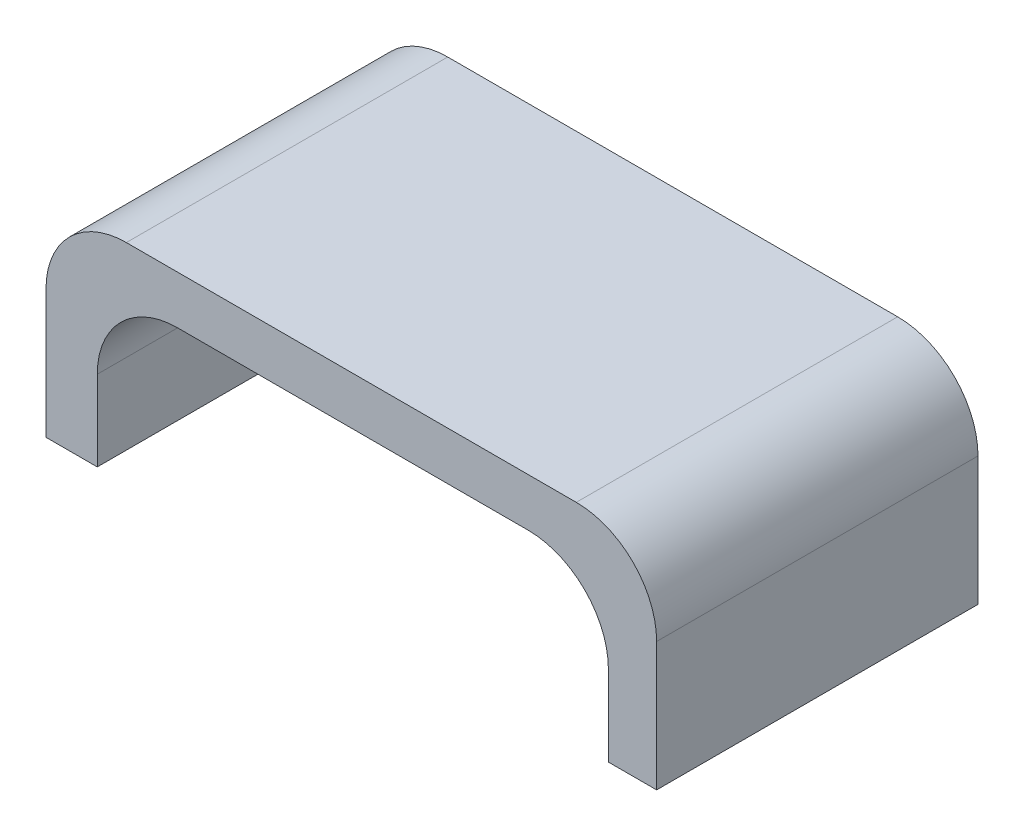
ISO-10303-21;
HEADER;
FILE_DESCRIPTION(('STEP AP214'),'2;1');
FILE_NAME('part.step','',(''),(''),'','','');
FILE_SCHEMA(('AUTOMOTIVE_DESIGN { 1 0 10303 214 1 1 1 1 }'));
ENDSEC;
DATA;
#1=APPLICATION_CONTEXT('core data for automotive mechanical design processes');
#2=APPLICATION_PROTOCOL_DEFINITION('international standard','automotive_design',2000,#1);
#3=PRODUCT_CONTEXT('',#1,'mechanical');
#4=PRODUCT('Part','Part','',(#3));
#5=PRODUCT_RELATED_PRODUCT_CATEGORY('part','',(#4));
#6=PRODUCT_DEFINITION_FORMATION('','',#4);
#7=PRODUCT_DEFINITION_CONTEXT('part definition',#1,'design');
#8=PRODUCT_DEFINITION('design','',#6,#7);
#9=PRODUCT_DEFINITION_SHAPE('','',#8);
#10=(LENGTH_UNIT() NAMED_UNIT(*) SI_UNIT(.MILLI.,.METRE.));
#11=(NAMED_UNIT(*) PLANE_ANGLE_UNIT() SI_UNIT($,.RADIAN.));
#12=(NAMED_UNIT(*) SI_UNIT($,.STERADIAN.) SOLID_ANGLE_UNIT());
#13=UNCERTAINTY_MEASURE_WITH_UNIT(LENGTH_MEASURE(1.E-05),#10,'distance_accuracy_value','');
#14=(GEOMETRIC_REPRESENTATION_CONTEXT(3) GLOBAL_UNCERTAINTY_ASSIGNED_CONTEXT((#13)) GLOBAL_UNIT_ASSIGNED_CONTEXT((#10,
#11,#12)) REPRESENTATION_CONTEXT('',''));
#15=CARTESIAN_POINT('',(0.,0.,0.));
#16=DIRECTION('',(0.,0.,1.));
#17=DIRECTION('',(1.,0.,0.));
#18=AXIS2_PLACEMENT_3D('',#15,#16,#17);
#19=CARTESIAN_POINT('',(-37.9999998133173,14.0053268917342,40.));
#20=DIRECTION('',(0.,1.,0.));
#21=DIRECTION('',(0.,0.,1.));
#22=AXIS2_PLACEMENT_3D('',#19,#20,#21);
#23=PLANE('',#22);
#24=DIRECTION('',(1.,0.,0.));
#25=VECTOR('',#24,1.);
#26=CARTESIAN_POINT('',(-37.9999998133173,14.0053268917342,0.));
#27=LINE('',#26,#25);
#28=CARTESIAN_POINT('',(-37.9999998133173,14.0053268917342,0.));
#29=VERTEX_POINT('',#28);
#30=CARTESIAN_POINT('',(-31.6160558921994,14.0053268917342,0.));
#31=VERTEX_POINT('',#30);
#32=EDGE_CURVE('E158',#29,#31,#27,.T.);
#33=ORIENTED_EDGE('',*,*,#32,.T.);
#34=DIRECTION('',(0.,0.,-1.));
#35=VECTOR('',#34,1.);
#36=CARTESIAN_POINT('',(-31.6160558921994,14.0053268917342,40.));
#37=LINE('',#36,#35);
#38=CARTESIAN_POINT('',(-31.6160558921994,14.0053268917342,40.));
#39=VERTEX_POINT('',#38);
#40=EDGE_CURVE('E11',#39,#31,#37,.T.);
#41=ORIENTED_EDGE('',*,*,#40,.F.);
#42=DIRECTION('',(1.,0.,0.));
#43=VECTOR('',#42,1.);
#44=CARTESIAN_POINT('',(-37.9999998133173,14.0053268917342,40.));
#45=LINE('',#44,#43);
#46=CARTESIAN_POINT('',(-37.9999998133173,14.0053268917342,40.));
#47=VERTEX_POINT('',#46);
#48=EDGE_CURVE('E182',#47,#39,#45,.T.);
#49=ORIENTED_EDGE('',*,*,#48,.F.);
#50=DIRECTION('',(0.,0.,-1.));
#51=VECTOR('',#50,1.);
#52=CARTESIAN_POINT('',(-37.9999998133173,14.0053268917342,40.));
#53=LINE('',#52,#51);
#54=EDGE_CURVE('E154',#47,#29,#53,.T.);
#55=ORIENTED_EDGE('',*,*,#54,.T.);
#56=EDGE_LOOP('',(#33,#41,#49,#55));
#57=FACE_BOUND('',#56,.T.);
#58=ADVANCED_FACE('F37',(#57),#23,.F.);
#59=CARTESIAN_POINT('',(-31.6160558921994,14.0053268917342,40.));
#60=DIRECTION('',(-1.,0.,0.));
#61=DIRECTION('',(0.,0.,1.));
#62=AXIS2_PLACEMENT_3D('',#59,#60,#61);
#63=PLANE('',#62);
#64=DIRECTION('',(0.,1.,0.));
#65=VECTOR('',#64,1.);
#66=CARTESIAN_POINT('',(-31.6160558921994,14.0053268917342,0.));
#67=LINE('',#66,#65);
#68=CARTESIAN_POINT('',(-31.6160558921994,23.9999999999999,0.));
#69=VERTEX_POINT('',#68);
#70=EDGE_CURVE('E161',#31,#69,#67,.T.);
#71=ORIENTED_EDGE('',*,*,#70,.T.);
#72=DIRECTION('',(0.,0.,-1.));
#73=VECTOR('',#72,1.);
#74=CARTESIAN_POINT('',(-31.6160558921994,23.9999999999999,40.));
#75=LINE('',#74,#73);
#76=CARTESIAN_POINT('',(-31.6160558921994,23.9999999999999,40.));
#77=VERTEX_POINT('',#76);
#78=EDGE_CURVE('E45',#77,#69,#75,.T.);
#79=ORIENTED_EDGE('',*,*,#78,.F.);
#80=DIRECTION('',(0.,1.,0.));
#81=VECTOR('',#80,1.);
#82=CARTESIAN_POINT('',(-31.6160558921994,14.0053268917342,40.));
#83=LINE('',#82,#81);
#84=EDGE_CURVE('E106',#39,#77,#83,.T.);
#85=ORIENTED_EDGE('',*,*,#84,.F.);
#86=ORIENTED_EDGE('',*,*,#40,.T.);
#87=EDGE_LOOP('',(#71,#79,#85,#86));
#88=FACE_BOUND('',#87,.T.);
#89=ADVANCED_FACE('F249',(#88),#63,.F.);
#90=CARTESIAN_POINT('',(-21.6160558921994,24.,40.));
#91=DIRECTION('',(0.,0.,-1.));
#92=DIRECTION('',(-1.,0.,0.));
#93=AXIS2_PLACEMENT_3D('',#90,#91,#92);
#94=CYLINDRICAL_SURFACE('',#93,10.);
#95=CARTESIAN_POINT('',(-21.6160558921994,24.,0.));
#96=DIRECTION('',(0.,0.,-1.));
#97=DIRECTION('',(-1.,0.,0.));
#98=AXIS2_PLACEMENT_3D('',#95,#96,#97);
#99=CIRCLE('',#98,10.);
#100=CARTESIAN_POINT('',(-21.6160558921993,34.,0.));
#101=VERTEX_POINT('',#100);
#102=EDGE_CURVE('E163',#69,#101,#99,.T.);
#103=ORIENTED_EDGE('',*,*,#102,.T.);
#104=DIRECTION('',(0.,0.,-1.));
#105=VECTOR('',#104,1.);
#106=CARTESIAN_POINT('',(-21.6160558921993,34.,40.));
#107=LINE('',#106,#105);
#108=CARTESIAN_POINT('',(-21.6160558921993,34.,40.));
#109=VERTEX_POINT('',#108);
#110=EDGE_CURVE('E201',#109,#101,#107,.T.);
#111=ORIENTED_EDGE('',*,*,#110,.F.);
#112=CARTESIAN_POINT('',(-21.6160558921994,24.,40.));
#113=DIRECTION('',(0.,0.,-1.));
#114=DIRECTION('',(-1.,0.,0.));
#115=AXIS2_PLACEMENT_3D('',#112,#113,#114);
#116=CIRCLE('',#115,10.);
#117=EDGE_CURVE('E209',#77,#109,#116,.T.);
#118=ORIENTED_EDGE('',*,*,#117,.F.);
#119=ORIENTED_EDGE('',*,*,#78,.T.);
#120=EDGE_LOOP('',(#103,#111,#118,#119));
#121=FACE_BOUND('',#120,.T.);
#122=ADVANCED_FACE('F207',(#121),#94,.F.);
#123=CARTESIAN_POINT('',(21.9999999999999,34.,40.));
#124=DIRECTION('',(0.,1.,0.));
#125=DIRECTION('',(-1.,0.,0.));
#126=AXIS2_PLACEMENT_3D('',#123,#124,#125);
#127=PLANE('',#126);
#128=DIRECTION('',(1.,0.,0.));
#129=VECTOR('',#128,1.);
#130=CARTESIAN_POINT('',(21.9999999999999,34.,0.));
#131=LINE('',#130,#129);
#132=CARTESIAN_POINT('',(21.9999999999999,34.,0.));
#133=VERTEX_POINT('',#132);
#134=EDGE_CURVE('E165',#101,#133,#131,.T.);
#135=ORIENTED_EDGE('',*,*,#134,.T.);
#136=DIRECTION('',(0.,0.,-1.));
#137=VECTOR('',#136,1.);
#138=CARTESIAN_POINT('',(21.9999999999999,34.,40.));
#139=LINE('',#138,#137);
#140=CARTESIAN_POINT('',(21.9999999999999,34.,40.));
#141=VERTEX_POINT('',#140);
#142=EDGE_CURVE('E198',#141,#133,#139,.T.);
#143=ORIENTED_EDGE('',*,*,#142,.F.);
#144=DIRECTION('',(1.,0.,0.));
#145=VECTOR('',#144,1.);
#146=CARTESIAN_POINT('',(21.9999999999999,34.,40.));
#147=LINE('',#146,#145);
#148=EDGE_CURVE('E225',#109,#141,#147,.T.);
#149=ORIENTED_EDGE('',*,*,#148,.F.);
#150=ORIENTED_EDGE('',*,*,#110,.T.);
#151=EDGE_LOOP('',(#135,#143,#149,#150));
#152=FACE_BOUND('',#151,.T.);
#153=ADVANCED_FACE('F216',(#152),#127,.F.);
#154=CARTESIAN_POINT('',(22.,24.,40.));
#155=DIRECTION('',(0.,0.,-1.));
#156=DIRECTION('',(-1.,0.,0.));
#157=AXIS2_PLACEMENT_3D('',#154,#155,#156);
#158=CYLINDRICAL_SURFACE('',#157,10.);
#159=CARTESIAN_POINT('',(22.,24.,0.));
#160=DIRECTION('',(0.,0.,-1.));
#161=DIRECTION('',(-1.,0.,0.));
#162=AXIS2_PLACEMENT_3D('',#159,#160,#161);
#163=CIRCLE('',#162,10.);
#164=CARTESIAN_POINT('',(32.,23.9999999999999,0.));
#165=VERTEX_POINT('',#164);
#166=EDGE_CURVE('E167',#133,#165,#163,.T.);
#167=ORIENTED_EDGE('',*,*,#166,.T.);
#168=DIRECTION('',(0.,0.,-1.));
#169=VECTOR('',#168,1.);
#170=CARTESIAN_POINT('',(32.,23.9999999999999,40.));
#171=LINE('',#170,#169);
#172=CARTESIAN_POINT('',(32.,23.9999999999999,40.));
#173=VERTEX_POINT('',#172);
#174=EDGE_CURVE('E195',#173,#165,#171,.T.);
#175=ORIENTED_EDGE('',*,*,#174,.F.);
#176=CARTESIAN_POINT('',(22.,24.,40.));
#177=DIRECTION('',(0.,0.,-1.));
#178=DIRECTION('',(-1.,0.,0.));
#179=AXIS2_PLACEMENT_3D('',#176,#177,#178);
#180=CIRCLE('',#179,10.);
#181=EDGE_CURVE('E222',#141,#173,#180,.T.);
#182=ORIENTED_EDGE('',*,*,#181,.F.);
#183=ORIENTED_EDGE('',*,*,#142,.T.);
#184=EDGE_LOOP('',(#167,#175,#182,#183));
#185=FACE_BOUND('',#184,.T.);
#186=ADVANCED_FACE('F220',(#185),#158,.F.);
#187=CARTESIAN_POINT('',(32.,14.,40.));
#188=DIRECTION('',(1.,0.,0.));
#189=DIRECTION('',(0.,0.,-1.));
#190=AXIS2_PLACEMENT_3D('',#187,#188,#189);
#191=PLANE('',#190);
#192=DIRECTION('',(0.,-1.,0.));
#193=VECTOR('',#192,1.);
#194=CARTESIAN_POINT('',(32.,14.,0.));
#195=LINE('',#194,#193);
#196=CARTESIAN_POINT('',(32.,14.,0.));
#197=VERTEX_POINT('',#196);
#198=EDGE_CURVE('E169',#165,#197,#195,.T.);
#199=ORIENTED_EDGE('',*,*,#198,.T.);
#200=DIRECTION('',(0.,0.,-1.));
#201=VECTOR('',#200,1.);
#202=CARTESIAN_POINT('',(32.,14.,40.));
#203=LINE('',#202,#201);
#204=CARTESIAN_POINT('',(32.,14.,40.));
#205=VERTEX_POINT('',#204);
#206=EDGE_CURVE('E192',#205,#197,#203,.T.);
#207=ORIENTED_EDGE('',*,*,#206,.F.);
#208=DIRECTION('',(0.,-1.,0.));
#209=VECTOR('',#208,1.);
#210=CARTESIAN_POINT('',(32.,14.,40.));
#211=LINE('',#210,#209);
#212=EDGE_CURVE('E224',#173,#205,#211,.T.);
#213=ORIENTED_EDGE('',*,*,#212,.F.);
#214=ORIENTED_EDGE('',*,*,#174,.T.);
#215=EDGE_LOOP('',(#199,#207,#213,#214));
#216=FACE_BOUND('',#215,.T.);
#217=ADVANCED_FACE('F261',(#216),#191,.F.);
#218=CARTESIAN_POINT('',(38.,14.,40.));
#219=DIRECTION('',(0.,1.,0.));
#220=DIRECTION('',(-1.,0.,0.));
#221=AXIS2_PLACEMENT_3D('',#218,#219,#220);
#222=PLANE('',#221);
#223=DIRECTION('',(1.,0.,0.));
#224=VECTOR('',#223,1.);
#225=CARTESIAN_POINT('',(38.,14.,0.));
#226=LINE('',#225,#224);
#227=CARTESIAN_POINT('',(38.,14.,0.));
#228=VERTEX_POINT('',#227);
#229=EDGE_CURVE('E171',#197,#228,#226,.T.);
#230=ORIENTED_EDGE('',*,*,#229,.T.);
#231=DIRECTION('',(0.,0.,-1.));
#232=VECTOR('',#231,1.);
#233=CARTESIAN_POINT('',(38.,14.,40.));
#234=LINE('',#233,#232);
#235=CARTESIAN_POINT('',(38.,14.,40.));
#236=VERTEX_POINT('',#235);
#237=EDGE_CURVE('E189',#236,#228,#234,.T.);
#238=ORIENTED_EDGE('',*,*,#237,.F.);
#239=DIRECTION('',(1.,0.,0.));
#240=VECTOR('',#239,1.);
#241=CARTESIAN_POINT('',(38.,14.,40.));
#242=LINE('',#241,#240);
#243=EDGE_CURVE('E227',#205,#236,#242,.T.);
#244=ORIENTED_EDGE('',*,*,#243,.F.);
#245=ORIENTED_EDGE('',*,*,#206,.T.);
#246=EDGE_LOOP('',(#230,#238,#244,#245));
#247=FACE_BOUND('',#246,.T.);
#248=ADVANCED_FACE('F264',(#247),#222,.F.);
#249=CARTESIAN_POINT('',(38.,20.,40.));
#250=DIRECTION('',(-1.,0.,0.));
#251=DIRECTION('',(0.,0.,1.));
#252=AXIS2_PLACEMENT_3D('',#249,#250,#251);
#253=PLANE('',#252);
#254=DIRECTION('',(0.,1.,0.));
#255=VECTOR('',#254,1.);
#256=CARTESIAN_POINT('',(38.,20.,0.));
#257=LINE('',#256,#255);
#258=CARTESIAN_POINT('',(38.,29.9999999999999,0.));
#259=VERTEX_POINT('',#258);
#260=EDGE_CURVE('E174',#228,#259,#257,.T.);
#261=ORIENTED_EDGE('',*,*,#260,.T.);
#262=DIRECTION('',(0.,0.,-1.));
#263=VECTOR('',#262,1.);
#264=CARTESIAN_POINT('',(38.,29.9999999999999,40.));
#265=LINE('',#264,#263);
#266=CARTESIAN_POINT('',(38.,29.9999999999999,40.));
#267=VERTEX_POINT('',#266);
#268=EDGE_CURVE('E186',#267,#259,#265,.T.);
#269=ORIENTED_EDGE('',*,*,#268,.F.);
#270=DIRECTION('',(0.,1.,0.));
#271=VECTOR('',#270,1.);
#272=CARTESIAN_POINT('',(38.,14.,40.));
#273=LINE('',#272,#271);
#274=EDGE_CURVE('E233',#236,#267,#273,.T.);
#275=ORIENTED_EDGE('',*,*,#274,.F.);
#276=ORIENTED_EDGE('',*,*,#237,.T.);
#277=EDGE_LOOP('',(#261,#269,#275,#276));
#278=FACE_BOUND('',#277,.T.);
#279=ADVANCED_FACE('F239',(#278),#253,.F.);
#280=CARTESIAN_POINT('',(28.,30.,40.));
#281=DIRECTION('',(0.,0.,-1.));
#282=DIRECTION('',(-1.,0.,0.));
#283=AXIS2_PLACEMENT_3D('',#280,#281,#282);
#284=CYLINDRICAL_SURFACE('',#283,10.);
#285=CARTESIAN_POINT('',(28.,30.,0.));
#286=DIRECTION('',(0.,0.,1.));
#287=DIRECTION('',(1.,0.,0.));
#288=AXIS2_PLACEMENT_3D('',#285,#286,#287);
#289=CIRCLE('',#288,10.);
#290=CARTESIAN_POINT('',(27.9999999999999,40.,0.));
#291=VERTEX_POINT('',#290);
#292=EDGE_CURVE('E176',#259,#291,#289,.T.);
#293=ORIENTED_EDGE('',*,*,#292,.T.);
#294=DIRECTION('',(0.,0.,-1.));
#295=VECTOR('',#294,1.);
#296=CARTESIAN_POINT('',(27.9999999999999,40.,40.));
#297=LINE('',#296,#295);
#298=CARTESIAN_POINT('',(27.9999999999999,40.,40.));
#299=VERTEX_POINT('',#298);
#300=EDGE_CURVE('E149',#299,#291,#297,.T.);
#301=ORIENTED_EDGE('',*,*,#300,.F.);
#302=CARTESIAN_POINT('',(28.,30.,40.));
#303=DIRECTION('',(0.,0.,1.));
#304=DIRECTION('',(1.,0.,0.));
#305=AXIS2_PLACEMENT_3D('',#302,#303,#304);
#306=CIRCLE('',#305,10.);
#307=EDGE_CURVE('E138',#267,#299,#306,.T.);
#308=ORIENTED_EDGE('',*,*,#307,.F.);
#309=ORIENTED_EDGE('',*,*,#268,.T.);
#310=EDGE_LOOP('',(#293,#301,#308,#309));
#311=FACE_BOUND('',#310,.T.);
#312=ADVANCED_FACE('F242',(#311),#284,.T.);
#313=CARTESIAN_POINT('',(27.9999999999999,40.,40.));
#314=DIRECTION('',(0.,-1.,0.));
#315=DIRECTION('',(0.,0.,-1.));
#316=AXIS2_PLACEMENT_3D('',#313,#314,#315);
#317=PLANE('',#316);
#318=DIRECTION('',(-1.,0.,0.));
#319=VECTOR('',#318,1.);
#320=CARTESIAN_POINT('',(27.9999999999999,40.,0.));
#321=LINE('',#320,#319);
#322=CARTESIAN_POINT('',(-27.9999998133172,40.,0.));
#323=VERTEX_POINT('',#322);
#324=EDGE_CURVE('E147',#291,#323,#321,.T.);
#325=ORIENTED_EDGE('',*,*,#324,.T.);
#326=DIRECTION('',(0.,0.,-1.));
#327=VECTOR('',#326,1.);
#328=CARTESIAN_POINT('',(-27.9999998133172,40.,40.));
#329=LINE('',#328,#327);
#330=CARTESIAN_POINT('',(-27.9999998133172,40.,40.));
#331=VERTEX_POINT('',#330);
#332=EDGE_CURVE('E144',#331,#323,#329,.T.);
#333=ORIENTED_EDGE('',*,*,#332,.F.);
#334=DIRECTION('',(-1.,0.,0.));
#335=VECTOR('',#334,1.);
#336=CARTESIAN_POINT('',(27.9999999999999,40.,40.));
#337=LINE('',#336,#335);
#338=EDGE_CURVE('E131',#299,#331,#337,.T.);
#339=ORIENTED_EDGE('',*,*,#338,.F.);
#340=ORIENTED_EDGE('',*,*,#300,.T.);
#341=EDGE_LOOP('',(#325,#333,#339,#340));
#342=FACE_BOUND('',#341,.T.);
#343=ADVANCED_FACE('F145',(#342),#317,.F.);
#344=CARTESIAN_POINT('',(-27.9999998133173,30.,40.));
#345=DIRECTION('',(0.,0.,-1.));
#346=DIRECTION('',(-1.,0.,0.));
#347=AXIS2_PLACEMENT_3D('',#344,#345,#346);
#348=CYLINDRICAL_SURFACE('',#347,10.);
#349=CARTESIAN_POINT('',(-27.9999998133173,30.,0.));
#350=DIRECTION('',(0.,0.,1.));
#351=DIRECTION('',(1.,0.,0.));
#352=AXIS2_PLACEMENT_3D('',#349,#350,#351);
#353=CIRCLE('',#352,10.);
#354=CARTESIAN_POINT('',(-37.9999998133173,29.9999999999999,0.));
#355=VERTEX_POINT('',#354);
#356=EDGE_CURVE('E179',#323,#355,#353,.T.);
#357=ORIENTED_EDGE('',*,*,#356,.T.);
#358=DIRECTION('',(0.,0.,-1.));
#359=VECTOR('',#358,1.);
#360=CARTESIAN_POINT('',(-37.9999998133173,29.9999999999999,40.));
#361=LINE('',#360,#359);
#362=CARTESIAN_POINT('',(-37.9999998133173,29.9999999999999,40.));
#363=VERTEX_POINT('',#362);
#364=EDGE_CURVE('E150',#363,#355,#361,.T.);
#365=ORIENTED_EDGE('',*,*,#364,.F.);
#366=CARTESIAN_POINT('',(-27.9999998133173,30.,40.));
#367=DIRECTION('',(0.,0.,1.));
#368=DIRECTION('',(1.,0.,0.));
#369=AXIS2_PLACEMENT_3D('',#366,#367,#368);
#370=CIRCLE('',#369,10.);
#371=EDGE_CURVE('E135',#331,#363,#370,.T.);
#372=ORIENTED_EDGE('',*,*,#371,.F.);
#373=ORIENTED_EDGE('',*,*,#332,.T.);
#374=EDGE_LOOP('',(#357,#365,#372,#373));
#375=FACE_BOUND('',#374,.T.);
#376=ADVANCED_FACE('F152',(#375),#348,.T.);
#377=CARTESIAN_POINT('',(-37.9999998133173,14.0053268917342,40.));
#378=DIRECTION('',(1.,0.,0.));
#379=DIRECTION('',(0.,0.,-1.));
#380=AXIS2_PLACEMENT_3D('',#377,#378,#379);
#381=PLANE('',#380);
#382=DIRECTION('',(0.,-1.,0.));
#383=VECTOR('',#382,1.);
#384=CARTESIAN_POINT('',(-37.9999998133173,14.0053268917342,0.));
#385=LINE('',#384,#383);
#386=EDGE_CURVE('E94',#355,#29,#385,.T.);
#387=ORIENTED_EDGE('',*,*,#386,.T.);
#388=ORIENTED_EDGE('',*,*,#54,.F.);
#389=DIRECTION('',(0.,-1.,0.));
#390=VECTOR('',#389,1.);
#391=CARTESIAN_POINT('',(-37.9999998133173,29.9999999999999,40.));
#392=LINE('',#391,#390);
#393=EDGE_CURVE('E53',#363,#47,#392,.T.);
#394=ORIENTED_EDGE('',*,*,#393,.F.);
#395=ORIENTED_EDGE('',*,*,#364,.T.);
#396=EDGE_LOOP('',(#387,#388,#394,#395));
#397=FACE_BOUND('',#396,.T.);
#398=ADVANCED_FACE('F243',(#397),#381,.F.);
#399=CARTESIAN_POINT('',(-21.6160558921994,24.,40.));
#400=DIRECTION('',(0.,0.,-1.));
#401=DIRECTION('',(-1.,0.,0.));
#402=AXIS2_PLACEMENT_3D('',#399,#400,#401);
#403=PLANE('',#402);
#404=ORIENTED_EDGE('',*,*,#48,.T.);
#405=ORIENTED_EDGE('',*,*,#84,.T.);
#406=ORIENTED_EDGE('',*,*,#117,.T.);
#407=ORIENTED_EDGE('',*,*,#148,.T.);
#408=ORIENTED_EDGE('',*,*,#181,.T.);
#409=ORIENTED_EDGE('',*,*,#212,.T.);
#410=ORIENTED_EDGE('',*,*,#243,.T.);
#411=ORIENTED_EDGE('',*,*,#274,.T.);
#412=ORIENTED_EDGE('',*,*,#307,.T.);
#413=ORIENTED_EDGE('',*,*,#338,.T.);
#414=ORIENTED_EDGE('',*,*,#371,.T.);
#415=ORIENTED_EDGE('',*,*,#393,.T.);
#416=EDGE_LOOP('',(#404,#405,#406,#407,#408,#409,#410,#411,#412,#413,#414,#415));
#417=FACE_BOUND('',#416,.T.);
#418=ADVANCED_FACE('F133',(#417),#403,.F.);
#419=CARTESIAN_POINT('',(-21.6160558921994,24.,0.));
#420=DIRECTION('',(0.,0.,-1.));
#421=DIRECTION('',(-1.,0.,0.));
#422=AXIS2_PLACEMENT_3D('',#419,#420,#421);
#423=PLANE('',#422);
#424=ORIENTED_EDGE('',*,*,#32,.F.);
#425=ORIENTED_EDGE('',*,*,#386,.F.);
#426=ORIENTED_EDGE('',*,*,#356,.F.);
#427=ORIENTED_EDGE('',*,*,#324,.F.);
#428=ORIENTED_EDGE('',*,*,#292,.F.);
#429=ORIENTED_EDGE('',*,*,#260,.F.);
#430=ORIENTED_EDGE('',*,*,#229,.F.);
#431=ORIENTED_EDGE('',*,*,#198,.F.);
#432=ORIENTED_EDGE('',*,*,#166,.F.);
#433=ORIENTED_EDGE('',*,*,#134,.F.);
#434=ORIENTED_EDGE('',*,*,#102,.F.);
#435=ORIENTED_EDGE('',*,*,#70,.F.);
#436=EDGE_LOOP('',(#424,#425,#426,#427,#428,#429,#430,#431,#432,#433,#434,#435));
#437=FACE_BOUND('',#436,.T.);
#438=ADVANCED_FACE('F211',(#437),#423,.T.);
#439=CLOSED_SHELL('',(#58,#89,#122,#153,#186,#217,#248,#279,#312,#343,#376,#398,#418,#438));
#440=MANIFOLD_SOLID_BREP('B2',#439);
#441=ADVANCED_BREP_SHAPE_REPRESENTATION('',(#18,#440),#14);
#442=SHAPE_DEFINITION_REPRESENTATION(#9,#441);
ENDSEC;
END-ISO-10303-21;
